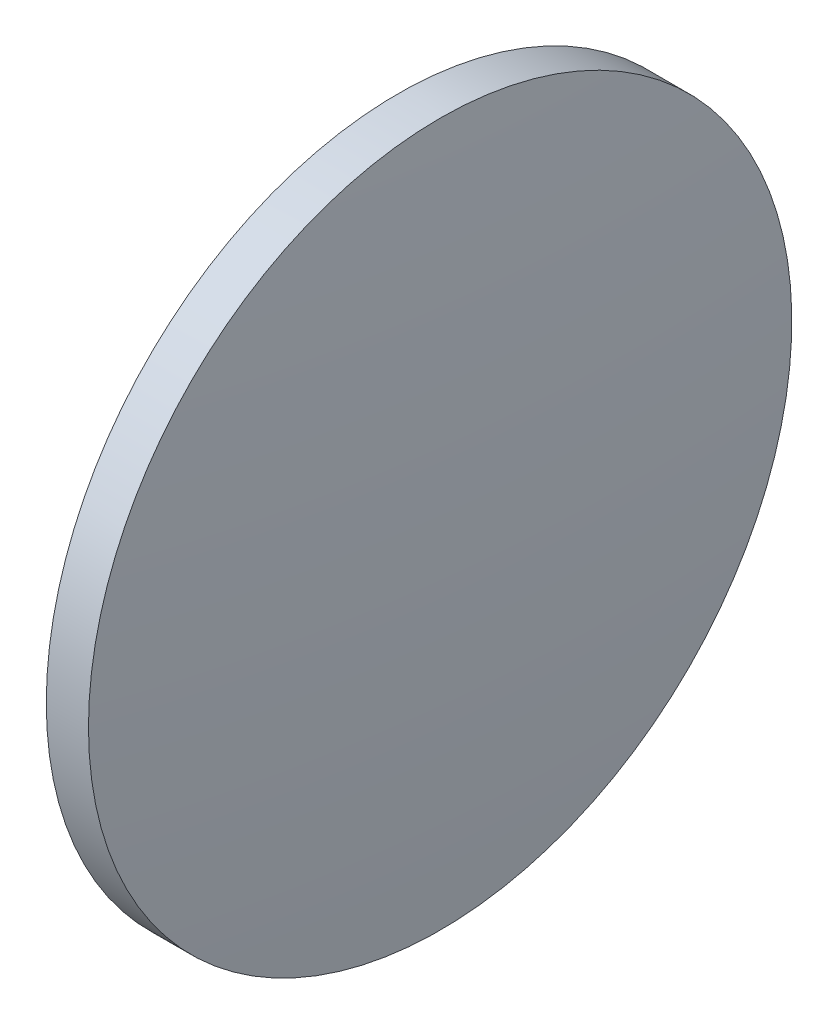
ISO-10303-21;
HEADER;
FILE_DESCRIPTION(('STEP AP214'),'2;1');
FILE_NAME('part.step','',(''),(''),'','','');
FILE_SCHEMA(('AUTOMOTIVE_DESIGN { 1 0 10303 214 1 1 1 1 }'));
ENDSEC;
DATA;
#1=APPLICATION_CONTEXT('core data for automotive mechanical design processes');
#2=APPLICATION_PROTOCOL_DEFINITION('international standard','automotive_design',2000,#1);
#3=PRODUCT_CONTEXT('',#1,'mechanical');
#4=PRODUCT('Part','Part','',(#3));
#5=PRODUCT_RELATED_PRODUCT_CATEGORY('part','',(#4));
#6=PRODUCT_DEFINITION_FORMATION('','',#4);
#7=PRODUCT_DEFINITION_CONTEXT('part definition',#1,'design');
#8=PRODUCT_DEFINITION('design','',#6,#7);
#9=PRODUCT_DEFINITION_SHAPE('','',#8);
#10=(LENGTH_UNIT() NAMED_UNIT(*) SI_UNIT(.MILLI.,.METRE.));
#11=(NAMED_UNIT(*) PLANE_ANGLE_UNIT() SI_UNIT($,.RADIAN.));
#12=(NAMED_UNIT(*) SI_UNIT($,.STERADIAN.) SOLID_ANGLE_UNIT());
#13=UNCERTAINTY_MEASURE_WITH_UNIT(LENGTH_MEASURE(1.E-05),#10,'distance_accuracy_value','');
#14=(GEOMETRIC_REPRESENTATION_CONTEXT(3) GLOBAL_UNCERTAINTY_ASSIGNED_CONTEXT((#13)) GLOBAL_UNIT_ASSIGNED_CONTEXT((#10,
#11,#12)) REPRESENTATION_CONTEXT('',''));
#15=CARTESIAN_POINT('',(0.,0.,0.));
#16=DIRECTION('',(0.,0.,1.));
#17=DIRECTION('',(1.,0.,0.));
#18=AXIS2_PLACEMENT_3D('',#15,#16,#17);
#19=CARTESIAN_POINT('',(338.479271374694,143.858480455821,0.));
#20=DIRECTION('',(-1.,0.,0.));
#21=DIRECTION('',(0.,1.,0.));
#22=AXIS2_PLACEMENT_3D('',#19,#20,#21);
#23=SPHERICAL_SURFACE('',#22,156.5);
#24=CARTESIAN_POINT('',(494.479271374694,143.858480455821,0.));
#25=DIRECTION('',(-1.,0.,0.));
#26=DIRECTION('',(0.,0.,1.));
#27=AXIS2_PLACEMENT_3D('',#24,#25,#26);
#28=CIRCLE('',#27,12.5);
#29=CARTESIAN_POINT('',(494.479271374694,143.858480455821,12.5));
#30=VERTEX_POINT('',#29);
#31=EDGE_CURVE('E10',#30,#30,#28,.T.);
#32=ORIENTED_EDGE('',*,*,#31,.F.);
#33=EDGE_LOOP('',(#32));
#34=FACE_BOUND('',#33,.T.);
#35=ADVANCED_FACE('F35',(#34),#23,.T.);
#36=CARTESIAN_POINT('',(490.613655471933,143.858480455821,0.));
#37=DIRECTION('',(-1.,0.,0.));
#38=DIRECTION('',(0.,0.,1.));
#39=AXIS2_PLACEMENT_3D('',#36,#37,#38);
#40=CYLINDRICAL_SURFACE('',#39,12.5);
#41=CARTESIAN_POINT('',(492.979271374694,143.858480455821,0.));
#42=DIRECTION('',(-1.,0.,0.));
#43=DIRECTION('',(0.,0.,1.));
#44=AXIS2_PLACEMENT_3D('',#41,#42,#43);
#45=CIRCLE('',#44,12.5);
#46=CARTESIAN_POINT('',(492.979271374694,143.858480455821,12.5));
#47=VERTEX_POINT('',#46);
#48=EDGE_CURVE('E41',#47,#47,#45,.T.);
#49=ORIENTED_EDGE('',*,*,#48,.F.);
#50=EDGE_LOOP('',(#49));
#51=FACE_BOUND('',#50,.T.);
#52=ORIENTED_EDGE('',*,*,#31,.T.);
#53=EDGE_LOOP('',(#52));
#54=FACE_BOUND('',#53,.T.);
#55=ADVANCED_FACE('F49',(#51,#54),#40,.T.);
#56=CARTESIAN_POINT('',(492.979271374694,143.858480455821,0.));
#57=DIRECTION('',(1.,0.,0.));
#58=DIRECTION('',(0.,0.,-1.));
#59=AXIS2_PLACEMENT_3D('',#56,#57,#58);
#60=PLANE('',#59);
#61=ORIENTED_EDGE('',*,*,#48,.T.);
#62=EDGE_LOOP('',(#61));
#63=FACE_BOUND('',#62,.T.);
#64=ADVANCED_FACE('F47',(#63),#60,.F.);
#65=CLOSED_SHELL('',(#35,#55,#64));
#66=MANIFOLD_SOLID_BREP('B2',#65);
#67=ADVANCED_BREP_SHAPE_REPRESENTATION('',(#18,#66),#14);
#68=SHAPE_DEFINITION_REPRESENTATION(#9,#67);
ENDSEC;
END-ISO-10303-21;
